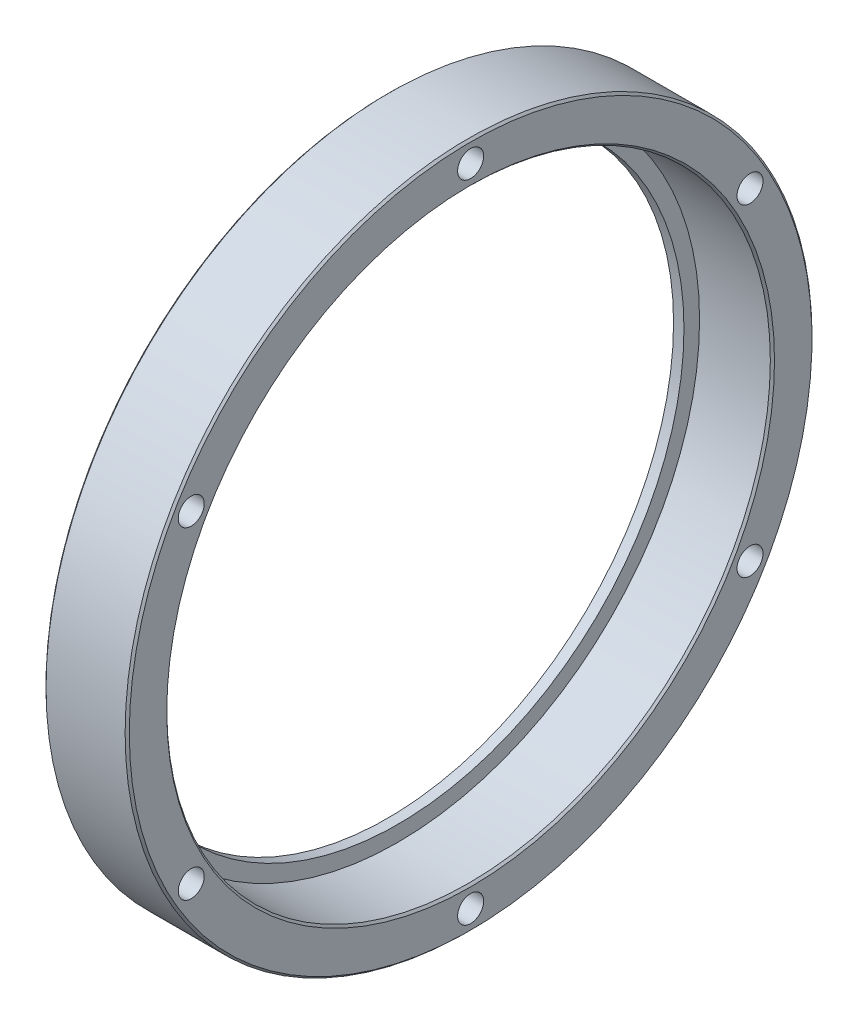
ISO-10303-21;
HEADER;
FILE_DESCRIPTION(('STEP AP214'),'2;1');
FILE_NAME('part.step','',(''),(''),'','','');
FILE_SCHEMA(('AUTOMOTIVE_DESIGN { 1 0 10303 214 1 1 1 1 }'));
ENDSEC;
DATA;
#1=APPLICATION_CONTEXT('core data for automotive mechanical design processes');
#2=APPLICATION_PROTOCOL_DEFINITION('international standard','automotive_design',2000,#1);
#3=PRODUCT_CONTEXT('',#1,'mechanical');
#4=PRODUCT('Part','Part','',(#3));
#5=PRODUCT_RELATED_PRODUCT_CATEGORY('part','',(#4));
#6=PRODUCT_DEFINITION_FORMATION('','',#4);
#7=PRODUCT_DEFINITION_CONTEXT('part definition',#1,'design');
#8=PRODUCT_DEFINITION('design','',#6,#7);
#9=PRODUCT_DEFINITION_SHAPE('','',#8);
#10=(LENGTH_UNIT() NAMED_UNIT(*) SI_UNIT(.MILLI.,.METRE.));
#11=(NAMED_UNIT(*) PLANE_ANGLE_UNIT() SI_UNIT($,.RADIAN.));
#12=(NAMED_UNIT(*) SI_UNIT($,.STERADIAN.) SOLID_ANGLE_UNIT());
#13=UNCERTAINTY_MEASURE_WITH_UNIT(LENGTH_MEASURE(1.E-05),#10,'distance_accuracy_value','');
#14=(GEOMETRIC_REPRESENTATION_CONTEXT(3) GLOBAL_UNCERTAINTY_ASSIGNED_CONTEXT((#13)) GLOBAL_UNIT_ASSIGNED_CONTEXT((#10,
#11,#12)) REPRESENTATION_CONTEXT('',''));
#15=CARTESIAN_POINT('',(0.,0.,0.));
#16=DIRECTION('',(0.,0.,1.));
#17=DIRECTION('',(1.,0.,0.));
#18=AXIS2_PLACEMENT_3D('',#15,#16,#17);
#19=CARTESIAN_POINT('',(8.,33.,0.));
#20=DIRECTION('',(-1.,0.,0.));
#21=DIRECTION('',(0.,0.,1.));
#22=AXIS2_PLACEMENT_3D('',#19,#20,#21);
#23=PLANE('',#22);
#24=CARTESIAN_POINT('',(8.,0.,0.));
#25=DIRECTION('',(-1.,0.,0.));
#26=DIRECTION('',(0.,0.,1.));
#27=AXIS2_PLACEMENT_3D('',#24,#25,#26);
#28=CIRCLE('',#27,32.8);
#29=CARTESIAN_POINT('',(8.,0.,32.8));
#30=VERTEX_POINT('',#29);
#31=EDGE_CURVE('E47',#30,#30,#28,.F.);
#32=ORIENTED_EDGE('',*,*,#31,.T.);
#33=EDGE_LOOP('',(#32));
#34=FACE_BOUND('',#33,.T.);
#35=CARTESIAN_POINT('',(8.,0.,0.));
#36=DIRECTION('',(-1.,0.,0.));
#37=DIRECTION('',(0.,0.,1.));
#38=AXIS2_PLACEMENT_3D('',#35,#36,#37);
#39=CIRCLE('',#38,29.2);
#40=CARTESIAN_POINT('',(8.,0.,29.2));
#41=VERTEX_POINT('',#40);
#42=EDGE_CURVE('E51',#41,#41,#39,.T.);
#43=ORIENTED_EDGE('',*,*,#42,.T.);
#44=EDGE_LOOP('',(#43));
#45=FACE_BOUND('',#44,.T.);
#46=CARTESIAN_POINT('',(8.,15.5000000000003,-26.8467875173174));
#47=DIRECTION('',(1.,0.,0.));
#48=DIRECTION('',(0.,0.,-1.));
#49=AXIS2_PLACEMENT_3D('',#46,#47,#48);
#50=CIRCLE('',#49,1.24999999999999);
#51=CARTESIAN_POINT('',(8.,15.5000000000003,-28.0967875173174));
#52=VERTEX_POINT('',#51);
#53=EDGE_CURVE('E108',#52,#52,#50,.T.);
#54=ORIENTED_EDGE('',*,*,#53,.F.);
#55=EDGE_LOOP('',(#54));
#56=FACE_BOUND('',#55,.T.);
#57=CARTESIAN_POINT('',(8.,-15.4999999999997,-26.8467875173177));
#58=DIRECTION('',(1.,0.,0.));
#59=DIRECTION('',(0.,0.,-1.));
#60=AXIS2_PLACEMENT_3D('',#57,#58,#59);
#61=CIRCLE('',#60,1.24999999999999);
#62=CARTESIAN_POINT('',(8.,-15.4999999999997,-28.0967875173177));
#63=VERTEX_POINT('',#62);
#64=EDGE_CURVE('E102',#63,#63,#61,.T.);
#65=ORIENTED_EDGE('',*,*,#64,.F.);
#66=EDGE_LOOP('',(#65));
#67=FACE_BOUND('',#66,.T.);
#68=CARTESIAN_POINT('',(8.,-15.5000000000001,26.8467875173175));
#69=DIRECTION('',(1.,0.,0.));
#70=DIRECTION('',(0.,0.,-1.));
#71=AXIS2_PLACEMENT_3D('',#68,#69,#70);
#72=CIRCLE('',#71,1.24999999999999);
#73=CARTESIAN_POINT('',(8.,-15.5000000000001,25.5967875173175));
#74=VERTEX_POINT('',#73);
#75=EDGE_CURVE('E90',#74,#74,#72,.T.);
#76=ORIENTED_EDGE('',*,*,#75,.F.);
#77=EDGE_LOOP('',(#76));
#78=FACE_BOUND('',#77,.T.);
#79=CARTESIAN_POINT('',(8.,15.4999999999999,26.8467875173176));
#80=DIRECTION('',(1.,0.,0.));
#81=DIRECTION('',(0.,0.,-1.));
#82=AXIS2_PLACEMENT_3D('',#79,#80,#81);
#83=CIRCLE('',#82,1.24999999999999);
#84=CARTESIAN_POINT('',(8.,15.4999999999999,25.5967875173176));
#85=VERTEX_POINT('',#84);
#86=EDGE_CURVE('E84',#85,#85,#83,.T.);
#87=ORIENTED_EDGE('',*,*,#86,.F.);
#88=EDGE_LOOP('',(#87));
#89=FACE_BOUND('',#88,.T.);
#90=CARTESIAN_POINT('',(8.,31.,0.));
#91=DIRECTION('',(1.,0.,0.));
#92=DIRECTION('',(0.,0.,-1.));
#93=AXIS2_PLACEMENT_3D('',#90,#91,#92);
#94=CIRCLE('',#93,1.24999999999999);
#95=CARTESIAN_POINT('',(8.,31.,-1.24999999999999));
#96=VERTEX_POINT('',#95);
#97=EDGE_CURVE('E78',#96,#96,#94,.T.);
#98=ORIENTED_EDGE('',*,*,#97,.F.);
#99=EDGE_LOOP('',(#98));
#100=FACE_BOUND('',#99,.T.);
#101=CARTESIAN_POINT('',(8.,-31.,0.));
#102=DIRECTION('',(1.,0.,0.));
#103=DIRECTION('',(0.,0.,-1.));
#104=AXIS2_PLACEMENT_3D('',#101,#102,#103);
#105=CIRCLE('',#104,1.24999999999999);
#106=CARTESIAN_POINT('',(8.,-31.,-1.24999999999999));
#107=VERTEX_POINT('',#106);
#108=EDGE_CURVE('E96',#107,#107,#105,.T.);
#109=ORIENTED_EDGE('',*,*,#108,.F.);
#110=EDGE_LOOP('',(#109));
#111=FACE_BOUND('',#110,.T.);
#112=ADVANCED_FACE('F39',(#34,#45,#56,#67,#78,#89,#100,#111),#23,.F.);
#113=CARTESIAN_POINT('',(0.,0.,0.));
#114=DIRECTION('',(-1.,0.,0.));
#115=DIRECTION('',(0.,0.,1.));
#116=AXIS2_PLACEMENT_3D('',#113,#114,#115);
#117=CYLINDRICAL_SURFACE('',#116,27.5);
#118=CARTESIAN_POINT('',(1.,0.,0.));
#119=DIRECTION('',(-1.,0.,0.));
#120=DIRECTION('',(0.,0.,1.));
#121=AXIS2_PLACEMENT_3D('',#118,#119,#120);
#122=CIRCLE('',#121,27.5);
#123=CARTESIAN_POINT('',(1.,0.,27.5));
#124=VERTEX_POINT('',#123);
#125=EDGE_CURVE('E72',#124,#124,#122,.T.);
#126=ORIENTED_EDGE('',*,*,#125,.F.);
#127=EDGE_LOOP('',(#126));
#128=FACE_BOUND('',#127,.T.);
#129=CARTESIAN_POINT('',(0.,0.,0.));
#130=DIRECTION('',(-1.,0.,0.));
#131=DIRECTION('',(0.,0.,1.));
#132=AXIS2_PLACEMENT_3D('',#129,#130,#131);
#133=CIRCLE('',#132,27.5);
#134=CARTESIAN_POINT('',(0.,0.,27.5));
#135=VERTEX_POINT('',#134);
#136=EDGE_CURVE('E66',#135,#135,#133,.T.);
#137=ORIENTED_EDGE('',*,*,#136,.T.);
#138=EDGE_LOOP('',(#137));
#139=FACE_BOUND('',#138,.T.);
#140=ADVANCED_FACE('F116',(#128,#139),#117,.F.);
#141=CARTESIAN_POINT('',(0.,27.5,0.));
#142=DIRECTION('',(1.,0.,0.));
#143=DIRECTION('',(0.,0.,-1.));
#144=AXIS2_PLACEMENT_3D('',#141,#142,#143);
#145=PLANE('',#144);
#146=CARTESIAN_POINT('',(0.,0.,0.));
#147=DIRECTION('',(1.,0.,0.));
#148=DIRECTION('',(0.,0.,-1.));
#149=AXIS2_PLACEMENT_3D('',#146,#147,#148);
#150=CIRCLE('',#149,32.8);
#151=CARTESIAN_POINT('',(0.,0.,-32.8));
#152=VERTEX_POINT('',#151);
#153=EDGE_CURVE('E63',#152,#152,#150,.F.);
#154=ORIENTED_EDGE('',*,*,#153,.T.);
#155=EDGE_LOOP('',(#154));
#156=FACE_BOUND('',#155,.T.);
#157=CARTESIAN_POINT('',(0.,15.5000000000003,-26.8467875173174));
#158=DIRECTION('',(1.,0.,0.));
#159=DIRECTION('',(0.,0.,-1.));
#160=AXIS2_PLACEMENT_3D('',#157,#158,#159);
#161=CIRCLE('',#160,1.25);
#162=CARTESIAN_POINT('',(0.,15.5000000000003,-28.0967875173174));
#163=VERTEX_POINT('',#162);
#164=EDGE_CURVE('E105',#163,#163,#161,.T.);
#165=ORIENTED_EDGE('',*,*,#164,.T.);
#166=EDGE_LOOP('',(#165));
#167=FACE_BOUND('',#166,.T.);
#168=CARTESIAN_POINT('',(0.,-15.4999999999997,-26.8467875173177));
#169=DIRECTION('',(1.,0.,0.));
#170=DIRECTION('',(0.,0.,-1.));
#171=AXIS2_PLACEMENT_3D('',#168,#169,#170);
#172=CIRCLE('',#171,1.25);
#173=CARTESIAN_POINT('',(0.,-15.4999999999997,-28.0967875173177));
#174=VERTEX_POINT('',#173);
#175=EDGE_CURVE('E99',#174,#174,#172,.T.);
#176=ORIENTED_EDGE('',*,*,#175,.T.);
#177=EDGE_LOOP('',(#176));
#178=FACE_BOUND('',#177,.T.);
#179=CARTESIAN_POINT('',(0.,-31.,0.));
#180=DIRECTION('',(1.,0.,0.));
#181=DIRECTION('',(0.,0.,-1.));
#182=AXIS2_PLACEMENT_3D('',#179,#180,#181);
#183=CIRCLE('',#182,1.25);
#184=CARTESIAN_POINT('',(0.,-31.,-1.25));
#185=VERTEX_POINT('',#184);
#186=EDGE_CURVE('E93',#185,#185,#183,.T.);
#187=ORIENTED_EDGE('',*,*,#186,.T.);
#188=EDGE_LOOP('',(#187));
#189=FACE_BOUND('',#188,.T.);
#190=CARTESIAN_POINT('',(0.,-15.5000000000001,26.8467875173175));
#191=DIRECTION('',(1.,0.,0.));
#192=DIRECTION('',(0.,0.,-1.));
#193=AXIS2_PLACEMENT_3D('',#190,#191,#192);
#194=CIRCLE('',#193,1.25);
#195=CARTESIAN_POINT('',(0.,-15.5000000000001,25.5967875173175));
#196=VERTEX_POINT('',#195);
#197=EDGE_CURVE('E87',#196,#196,#194,.T.);
#198=ORIENTED_EDGE('',*,*,#197,.T.);
#199=EDGE_LOOP('',(#198));
#200=FACE_BOUND('',#199,.T.);
#201=CARTESIAN_POINT('',(0.,15.4999999999999,26.8467875173176));
#202=DIRECTION('',(1.,0.,0.));
#203=DIRECTION('',(0.,0.,-1.));
#204=AXIS2_PLACEMENT_3D('',#201,#202,#203);
#205=CIRCLE('',#204,1.25);
#206=CARTESIAN_POINT('',(0.,15.4999999999999,25.5967875173176));
#207=VERTEX_POINT('',#206);
#208=EDGE_CURVE('E81',#207,#207,#205,.T.);
#209=ORIENTED_EDGE('',*,*,#208,.T.);
#210=EDGE_LOOP('',(#209));
#211=FACE_BOUND('',#210,.T.);
#212=CARTESIAN_POINT('',(0.,31.,0.));
#213=DIRECTION('',(1.,0.,0.));
#214=DIRECTION('',(0.,0.,-1.));
#215=AXIS2_PLACEMENT_3D('',#212,#213,#214);
#216=CIRCLE('',#215,1.25);
#217=CARTESIAN_POINT('',(0.,31.,-1.25));
#218=VERTEX_POINT('',#217);
#219=EDGE_CURVE('E75',#218,#218,#216,.T.);
#220=ORIENTED_EDGE('',*,*,#219,.T.);
#221=EDGE_LOOP('',(#220));
#222=FACE_BOUND('',#221,.T.);
#223=ORIENTED_EDGE('',*,*,#136,.F.);
#224=EDGE_LOOP('',(#223));
#225=FACE_BOUND('',#224,.T.);
#226=ADVANCED_FACE('F163',(#156,#167,#178,#189,#200,#211,#222,#225),#145,.F.);
#227=CARTESIAN_POINT('',(0.,0.,0.));
#228=DIRECTION('',(-1.,0.,0.));
#229=DIRECTION('',(0.,0.,1.));
#230=AXIS2_PLACEMENT_3D('',#227,#228,#229);
#231=CYLINDRICAL_SURFACE('',#230,33.);
#232=CARTESIAN_POINT('',(0.200000000000006,0.,0.));
#233=DIRECTION('',(1.,0.,0.));
#234=DIRECTION('',(0.,0.,-1.));
#235=AXIS2_PLACEMENT_3D('',#232,#233,#234);
#236=CIRCLE('',#235,33.);
#237=CARTESIAN_POINT('',(0.200000000000006,0.,-33.));
#238=VERTEX_POINT('',#237);
#239=EDGE_CURVE('E55',#238,#238,#236,.T.);
#240=ORIENTED_EDGE('',*,*,#239,.T.);
#241=EDGE_LOOP('',(#240));
#242=FACE_BOUND('',#241,.T.);
#243=CARTESIAN_POINT('',(7.8,0.,0.));
#244=DIRECTION('',(-1.,0.,0.));
#245=DIRECTION('',(0.,0.,1.));
#246=AXIS2_PLACEMENT_3D('',#243,#244,#245);
#247=CIRCLE('',#246,33.);
#248=CARTESIAN_POINT('',(7.8,0.,33.));
#249=VERTEX_POINT('',#248);
#250=EDGE_CURVE('E60',#249,#249,#247,.T.);
#251=ORIENTED_EDGE('',*,*,#250,.T.);
#252=EDGE_LOOP('',(#251));
#253=FACE_BOUND('',#252,.T.);
#254=ADVANCED_FACE('F159',(#242,#253),#231,.T.);
#255=CARTESIAN_POINT('',(0.,0.,0.));
#256=DIRECTION('',(-1.,0.,0.));
#257=DIRECTION('',(0.,0.,1.));
#258=AXIS2_PLACEMENT_3D('',#255,#256,#257);
#259=CYLINDRICAL_SURFACE('',#258,29.);
#260=CARTESIAN_POINT('',(7.79999999999999,0.,0.));
#261=DIRECTION('',(-1.,0.,0.));
#262=DIRECTION('',(0.,0.,1.));
#263=AXIS2_PLACEMENT_3D('',#260,#261,#262);
#264=CIRCLE('',#263,29.);
#265=CARTESIAN_POINT('',(7.79999999999999,0.,29.));
#266=VERTEX_POINT('',#265);
#267=EDGE_CURVE('E10',#266,#266,#264,.F.);
#268=ORIENTED_EDGE('',*,*,#267,.T.);
#269=EDGE_LOOP('',(#268));
#270=FACE_BOUND('',#269,.T.);
#271=CARTESIAN_POINT('',(1.,0.,0.));
#272=DIRECTION('',(-1.,0.,0.));
#273=DIRECTION('',(0.,0.,1.));
#274=AXIS2_PLACEMENT_3D('',#271,#272,#273);
#275=CIRCLE('',#274,29.);
#276=CARTESIAN_POINT('',(1.,0.,29.));
#277=VERTEX_POINT('',#276);
#278=EDGE_CURVE('E69',#277,#277,#275,.T.);
#279=ORIENTED_EDGE('',*,*,#278,.T.);
#280=EDGE_LOOP('',(#279));
#281=FACE_BOUND('',#280,.T.);
#282=ADVANCED_FACE('F156',(#270,#281),#259,.F.);
#283=CARTESIAN_POINT('',(1.,29.,0.));
#284=DIRECTION('',(-1.,0.,0.));
#285=DIRECTION('',(0.,0.,1.));
#286=AXIS2_PLACEMENT_3D('',#283,#284,#285);
#287=PLANE('',#286);
#288=ORIENTED_EDGE('',*,*,#278,.F.);
#289=EDGE_LOOP('',(#288));
#290=FACE_BOUND('',#289,.T.);
#291=ORIENTED_EDGE('',*,*,#125,.T.);
#292=EDGE_LOOP('',(#291));
#293=FACE_BOUND('',#292,.T.);
#294=ADVANCED_FACE('F152',(#290,#293),#287,.F.);
#295=CARTESIAN_POINT('',(8.,31.,0.));
#296=DIRECTION('',(1.,0.,0.));
#297=DIRECTION('',(0.,0.,-1.));
#298=AXIS2_PLACEMENT_3D('',#295,#296,#297);
#299=CYLINDRICAL_SURFACE('',#298,1.24999999999999);
#300=ORIENTED_EDGE('',*,*,#219,.F.);
#301=EDGE_LOOP('',(#300));
#302=FACE_BOUND('',#301,.T.);
#303=ORIENTED_EDGE('',*,*,#97,.T.);
#304=EDGE_LOOP('',(#303));
#305=FACE_BOUND('',#304,.T.);
#306=ADVANCED_FACE('F148',(#302,#305),#299,.F.);
#307=CARTESIAN_POINT('',(8.,15.4999999999999,26.8467875173176));
#308=DIRECTION('',(1.,0.,0.));
#309=DIRECTION('',(0.,0.,-1.));
#310=AXIS2_PLACEMENT_3D('',#307,#308,#309);
#311=CYLINDRICAL_SURFACE('',#310,1.24999999999999);
#312=ORIENTED_EDGE('',*,*,#208,.F.);
#313=EDGE_LOOP('',(#312));
#314=FACE_BOUND('',#313,.T.);
#315=ORIENTED_EDGE('',*,*,#86,.T.);
#316=EDGE_LOOP('',(#315));
#317=FACE_BOUND('',#316,.T.);
#318=ADVANCED_FACE('F140',(#314,#317),#311,.F.);
#319=CARTESIAN_POINT('',(8.,-15.5000000000001,26.8467875173175));
#320=DIRECTION('',(1.,0.,0.));
#321=DIRECTION('',(0.,0.,-1.));
#322=AXIS2_PLACEMENT_3D('',#319,#320,#321);
#323=CYLINDRICAL_SURFACE('',#322,1.24999999999999);
#324=ORIENTED_EDGE('',*,*,#197,.F.);
#325=EDGE_LOOP('',(#324));
#326=FACE_BOUND('',#325,.T.);
#327=ORIENTED_EDGE('',*,*,#75,.T.);
#328=EDGE_LOOP('',(#327));
#329=FACE_BOUND('',#328,.T.);
#330=ADVANCED_FACE('F131',(#326,#329),#323,.F.);
#331=CARTESIAN_POINT('',(8.,-31.,0.));
#332=DIRECTION('',(1.,0.,0.));
#333=DIRECTION('',(0.,0.,-1.));
#334=AXIS2_PLACEMENT_3D('',#331,#332,#333);
#335=CYLINDRICAL_SURFACE('',#334,1.24999999999999);
#336=ORIENTED_EDGE('',*,*,#186,.F.);
#337=EDGE_LOOP('',(#336));
#338=FACE_BOUND('',#337,.T.);
#339=ORIENTED_EDGE('',*,*,#108,.T.);
#340=EDGE_LOOP('',(#339));
#341=FACE_BOUND('',#340,.T.);
#342=ADVANCED_FACE('F128',(#338,#341),#335,.F.);
#343=CARTESIAN_POINT('',(8.,-15.4999999999997,-26.8467875173177));
#344=DIRECTION('',(1.,0.,0.));
#345=DIRECTION('',(0.,0.,-1.));
#346=AXIS2_PLACEMENT_3D('',#343,#344,#345);
#347=CYLINDRICAL_SURFACE('',#346,1.24999999999999);
#348=ORIENTED_EDGE('',*,*,#175,.F.);
#349=EDGE_LOOP('',(#348));
#350=FACE_BOUND('',#349,.T.);
#351=ORIENTED_EDGE('',*,*,#64,.T.);
#352=EDGE_LOOP('',(#351));
#353=FACE_BOUND('',#352,.T.);
#354=ADVANCED_FACE('F130',(#350,#353),#347,.F.);
#355=CARTESIAN_POINT('',(8.,15.5000000000003,-26.8467875173174));
#356=DIRECTION('',(1.,0.,0.));
#357=DIRECTION('',(0.,0.,-1.));
#358=AXIS2_PLACEMENT_3D('',#355,#356,#357);
#359=CYLINDRICAL_SURFACE('',#358,1.24999999999999);
#360=ORIENTED_EDGE('',*,*,#164,.F.);
#361=EDGE_LOOP('',(#360));
#362=FACE_BOUND('',#361,.T.);
#363=ORIENTED_EDGE('',*,*,#53,.T.);
#364=EDGE_LOOP('',(#363));
#365=FACE_BOUND('',#364,.T.);
#366=ADVANCED_FACE('F112',(#362,#365),#359,.F.);
#367=CARTESIAN_POINT('',(0.,0.,0.));
#368=DIRECTION('',(1.,0.,0.));
#369=DIRECTION('',(0.,0.,-1.));
#370=AXIS2_PLACEMENT_3D('',#367,#368,#369);
#371=CONICAL_SURFACE('',#370,32.8,0.785398163397448);
#372=ORIENTED_EDGE('',*,*,#239,.F.);
#373=EDGE_LOOP('',(#372));
#374=FACE_BOUND('',#373,.T.);
#375=ORIENTED_EDGE('',*,*,#153,.F.);
#376=EDGE_LOOP('',(#375));
#377=FACE_BOUND('',#376,.T.);
#378=ADVANCED_FACE('F172',(#374,#377),#371,.T.);
#379=CARTESIAN_POINT('',(7.8,0.,0.));
#380=DIRECTION('',(-1.,0.,0.));
#381=DIRECTION('',(0.,0.,1.));
#382=AXIS2_PLACEMENT_3D('',#379,#380,#381);
#383=CONICAL_SURFACE('',#382,33.,0.785398163397483);
#384=ORIENTED_EDGE('',*,*,#31,.F.);
#385=EDGE_LOOP('',(#384));
#386=FACE_BOUND('',#385,.T.);
#387=ORIENTED_EDGE('',*,*,#250,.F.);
#388=EDGE_LOOP('',(#387));
#389=FACE_BOUND('',#388,.T.);
#390=ADVANCED_FACE('F177',(#386,#389),#383,.T.);
#391=CARTESIAN_POINT('',(8.,0.,0.));
#392=DIRECTION('',(1.,0.,0.));
#393=DIRECTION('',(0.,0.,-1.));
#394=AXIS2_PLACEMENT_3D('',#391,#392,#393);
#395=CONICAL_SURFACE('',#394,29.2,0.785398163397422);
#396=ORIENTED_EDGE('',*,*,#267,.F.);
#397=EDGE_LOOP('',(#396));
#398=FACE_BOUND('',#397,.T.);
#399=ORIENTED_EDGE('',*,*,#42,.F.);
#400=EDGE_LOOP('',(#399));
#401=FACE_BOUND('',#400,.T.);
#402=ADVANCED_FACE('F42',(#398,#401),#395,.F.);
#403=CLOSED_SHELL('',(#112,#140,#226,#254,#282,#294,#306,#318,#330,#342,#354,#366,#378,#390,#402));
#404=MANIFOLD_SOLID_BREP('B2',#403);
#405=ADVANCED_BREP_SHAPE_REPRESENTATION('',(#18,#404),#14);
#406=SHAPE_DEFINITION_REPRESENTATION(#9,#405);
ENDSEC;
END-ISO-10303-21;
